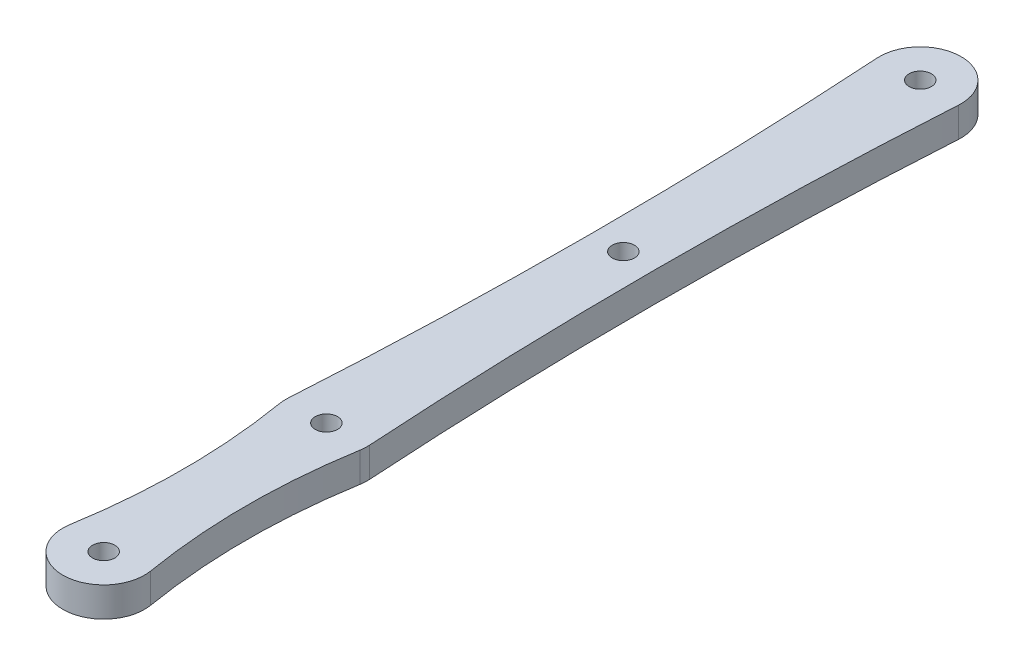
ISO-10303-21;
HEADER;
FILE_DESCRIPTION(('STEP AP214'),'2;1');
FILE_NAME('part.step','',(''),(''),'','','');
FILE_SCHEMA(('AUTOMOTIVE_DESIGN { 1 0 10303 214 1 1 1 1 }'));
ENDSEC;
DATA;
#1=APPLICATION_CONTEXT('core data for automotive mechanical design processes');
#2=APPLICATION_PROTOCOL_DEFINITION('international standard','automotive_design',2000,#1);
#3=PRODUCT_CONTEXT('',#1,'mechanical');
#4=PRODUCT('Part','Part','',(#3));
#5=PRODUCT_RELATED_PRODUCT_CATEGORY('part','',(#4));
#6=PRODUCT_DEFINITION_FORMATION('','',#4);
#7=PRODUCT_DEFINITION_CONTEXT('part definition',#1,'design');
#8=PRODUCT_DEFINITION('design','',#6,#7);
#9=PRODUCT_DEFINITION_SHAPE('','',#8);
#10=(LENGTH_UNIT() NAMED_UNIT(*) SI_UNIT(.MILLI.,.METRE.));
#11=(NAMED_UNIT(*) PLANE_ANGLE_UNIT() SI_UNIT($,.RADIAN.));
#12=(NAMED_UNIT(*) SI_UNIT($,.STERADIAN.) SOLID_ANGLE_UNIT());
#13=UNCERTAINTY_MEASURE_WITH_UNIT(LENGTH_MEASURE(1.E-05),#10,'distance_accuracy_value','');
#14=(GEOMETRIC_REPRESENTATION_CONTEXT(3) GLOBAL_UNCERTAINTY_ASSIGNED_CONTEXT((#13)) GLOBAL_UNIT_ASSIGNED_CONTEXT((#10,
#11,#12)) REPRESENTATION_CONTEXT('',''));
#15=CARTESIAN_POINT('',(0.,0.,0.));
#16=DIRECTION('',(0.,0.,1.));
#17=DIRECTION('',(1.,0.,0.));
#18=AXIS2_PLACEMENT_3D('',#15,#16,#17);
#19=CARTESIAN_POINT('',(-319.687499999935,4.,-89.9999999999999));
#20=DIRECTION('',(0.,1.,0.));
#21=DIRECTION('',(0.,0.,1.));
#22=AXIS2_PLACEMENT_3D('',#19,#20,#21);
#23=PLANE('',#22);
#24=CARTESIAN_POINT('',(0.,4.,-110.));
#25=DIRECTION('',(0.,1.,0.));
#26=DIRECTION('',(0.,0.,1.));
#27=AXIS2_PLACEMENT_3D('',#24,#25,#26);
#28=CIRCLE('',#27,1.5);
#29=CARTESIAN_POINT('',(0.,4.,-108.5));
#30=VERTEX_POINT('',#29);
#31=EDGE_CURVE('E188',#30,#30,#28,.T.);
#32=ORIENTED_EDGE('',*,*,#31,.F.);
#33=EDGE_LOOP('',(#32));
#34=FACE_BOUND('',#33,.T.);
#35=CARTESIAN_POINT('',(0.,4.,-30.));
#36=DIRECTION('',(0.,1.,0.));
#37=DIRECTION('',(0.,0.,1.));
#38=AXIS2_PLACEMENT_3D('',#35,#36,#37);
#39=CIRCLE('',#38,1.5);
#40=CARTESIAN_POINT('',(0.,4.,-28.5));
#41=VERTEX_POINT('',#40);
#42=EDGE_CURVE('E134',#41,#41,#39,.T.);
#43=ORIENTED_EDGE('',*,*,#42,.F.);
#44=EDGE_LOOP('',(#43));
#45=FACE_BOUND('',#44,.T.);
#46=CARTESIAN_POINT('',(-639.37499999987,4.,-69.9999999999999));
#47=DIRECTION('',(0.,-1.,0.));
#48=DIRECTION('',(0.,0.,1.));
#49=AXIS2_PLACEMENT_3D('',#46,#47,#48);
#50=CIRCLE('',#49,635.12499999987);
#51=CARTESIAN_POINT('',(-5.4892682926832,4.,-109.656585365854));
#52=VERTEX_POINT('',#51);
#53=CARTESIAN_POINT('',(-5.48926829268316,4.,-30.3434146341464));
#54=VERTEX_POINT('',#53);
#55=EDGE_CURVE('E145',#52,#54,#50,.T.);
#56=ORIENTED_EDGE('',*,*,#55,.T.);
#57=CARTESIAN_POINT('',(0.,4.,-30.));
#58=DIRECTION('',(0.,1.,0.));
#59=DIRECTION('',(0.,0.,1.));
#60=AXIS2_PLACEMENT_3D('',#57,#58,#59);
#61=CIRCLE('',#60,5.50000000000023);
#62=CARTESIAN_POINT('',(-5.42413793103468,4.,-29.0896551724136));
#63=VERTEX_POINT('',#62);
#64=EDGE_CURVE('E93',#54,#63,#61,.T.);
#65=ORIENTED_EDGE('',*,*,#64,.T.);
#66=CARTESIAN_POINT('',(-89.3749999999824,4.,-15.));
#67=DIRECTION('',(0.,-1.,0.));
#68=DIRECTION('',(0.,0.,1.));
#69=AXIS2_PLACEMENT_3D('',#66,#67,#68);
#70=CIRCLE('',#69,85.1249999999824);
#71=CARTESIAN_POINT('',(-5.42413793103468,4.,-0.91034482758642));
#72=VERTEX_POINT('',#71);
#73=EDGE_CURVE('E160',#63,#72,#70,.T.);
#74=ORIENTED_EDGE('',*,*,#73,.T.);
#75=CARTESIAN_POINT('',(0.,4.,0.));
#76=DIRECTION('',(0.,1.,0.));
#77=DIRECTION('',(0.,0.,1.));
#78=AXIS2_PLACEMENT_3D('',#75,#76,#77);
#79=CIRCLE('',#78,5.50000000000023);
#80=CARTESIAN_POINT('',(5.42413793103468,4.,-0.910344827586403));
#81=VERTEX_POINT('',#80);
#82=EDGE_CURVE('E173',#72,#81,#79,.T.);
#83=ORIENTED_EDGE('',*,*,#82,.T.);
#84=CARTESIAN_POINT('',(89.3749999999824,4.,-15.));
#85=DIRECTION('',(0.,-1.,0.));
#86=DIRECTION('',(0.,0.,-1.));
#87=AXIS2_PLACEMENT_3D('',#84,#85,#86);
#88=CIRCLE('',#87,85.1249999999824);
#89=CARTESIAN_POINT('',(5.42413793103469,4.,-29.0896551724136));
#90=VERTEX_POINT('',#89);
#91=EDGE_CURVE('E112',#81,#90,#88,.T.);
#92=ORIENTED_EDGE('',*,*,#91,.T.);
#93=CARTESIAN_POINT('',(0.,4.,-30.));
#94=DIRECTION('',(0.,1.,0.));
#95=DIRECTION('',(0.,0.,1.));
#96=AXIS2_PLACEMENT_3D('',#93,#94,#95);
#97=CIRCLE('',#96,5.50000000000024);
#98=CARTESIAN_POINT('',(5.48926829268315,4.,-30.3434146341465));
#99=VERTEX_POINT('',#98);
#100=EDGE_CURVE('E106',#90,#99,#97,.T.);
#101=ORIENTED_EDGE('',*,*,#100,.T.);
#102=CARTESIAN_POINT('',(639.37499999987,4.,-69.9999999999999));
#103=DIRECTION('',(0.,-1.,0.));
#104=DIRECTION('',(0.,0.,-1.));
#105=AXIS2_PLACEMENT_3D('',#102,#103,#104);
#106=CIRCLE('',#105,635.12499999987);
#107=CARTESIAN_POINT('',(5.48926829268316,4.,-109.656585365854));
#108=VERTEX_POINT('',#107);
#109=EDGE_CURVE('E110',#99,#108,#106,.T.);
#110=ORIENTED_EDGE('',*,*,#109,.T.);
#111=CARTESIAN_POINT('',(0.,4.,-110.));
#112=DIRECTION('',(0.,1.,0.));
#113=DIRECTION('',(0.,0.,1.));
#114=AXIS2_PLACEMENT_3D('',#111,#112,#113);
#115=CIRCLE('',#114,5.50000000000026);
#116=EDGE_CURVE('E50',#108,#52,#115,.T.);
#117=ORIENTED_EDGE('',*,*,#116,.T.);
#118=EDGE_LOOP('',(#56,#65,#74,#83,#92,#101,#110,#117));
#119=FACE_BOUND('',#118,.T.);
#120=CARTESIAN_POINT('',(0.,4.,0.));
#121=DIRECTION('',(0.,1.,0.));
#122=DIRECTION('',(0.,0.,1.));
#123=AXIS2_PLACEMENT_3D('',#120,#121,#122);
#124=CIRCLE('',#123,1.5);
#125=CARTESIAN_POINT('',(0.,4.,1.5));
#126=VERTEX_POINT('',#125);
#127=EDGE_CURVE('E182',#126,#126,#124,.T.);
#128=ORIENTED_EDGE('',*,*,#127,.F.);
#129=EDGE_LOOP('',(#128));
#130=FACE_BOUND('',#129,.T.);
#131=CARTESIAN_POINT('',(0.,4.,-70.));
#132=DIRECTION('',(0.,1.,0.));
#133=DIRECTION('',(0.,0.,1.));
#134=AXIS2_PLACEMENT_3D('',#131,#132,#133);
#135=CIRCLE('',#134,1.5);
#136=CARTESIAN_POINT('',(0.,4.,-68.5));
#137=VERTEX_POINT('',#136);
#138=EDGE_CURVE('E194',#137,#137,#135,.T.);
#139=ORIENTED_EDGE('',*,*,#138,.F.);
#140=EDGE_LOOP('',(#139));
#141=FACE_BOUND('',#140,.T.);
#142=ADVANCED_FACE('F33',(#34,#45,#119,#130,#141),#23,.T.);
#143=CARTESIAN_POINT('',(-319.687499999935,0.,-89.9999999999999));
#144=DIRECTION('',(0.,1.,0.));
#145=DIRECTION('',(0.,0.,1.));
#146=AXIS2_PLACEMENT_3D('',#143,#144,#145);
#147=PLANE('',#146);
#148=CARTESIAN_POINT('',(-639.37499999987,0.,-69.9999999999999));
#149=DIRECTION('',(0.,-1.,0.));
#150=DIRECTION('',(0.,0.,1.));
#151=AXIS2_PLACEMENT_3D('',#148,#149,#150);
#152=CIRCLE('',#151,635.12499999987);
#153=CARTESIAN_POINT('',(-5.4892682926832,0.,-109.656585365854));
#154=VERTEX_POINT('',#153);
#155=CARTESIAN_POINT('',(-5.48926829268316,0.,-30.3434146341464));
#156=VERTEX_POINT('',#155);
#157=EDGE_CURVE('E130',#154,#156,#152,.T.);
#158=ORIENTED_EDGE('',*,*,#157,.F.);
#159=CARTESIAN_POINT('',(0.,0.,-110.));
#160=DIRECTION('',(0.,1.,0.));
#161=DIRECTION('',(0.,0.,1.));
#162=AXIS2_PLACEMENT_3D('',#159,#160,#161);
#163=CIRCLE('',#162,5.50000000000026);
#164=CARTESIAN_POINT('',(5.48926829268316,0.,-109.656585365854));
#165=VERTEX_POINT('',#164);
#166=EDGE_CURVE('E85',#165,#154,#163,.T.);
#167=ORIENTED_EDGE('',*,*,#166,.F.);
#168=CARTESIAN_POINT('',(639.37499999987,0.,-69.9999999999999));
#169=DIRECTION('',(0.,-1.,0.));
#170=DIRECTION('',(0.,0.,-1.));
#171=AXIS2_PLACEMENT_3D('',#168,#169,#170);
#172=CIRCLE('',#171,635.12499999987);
#173=CARTESIAN_POINT('',(5.48926829268315,0.,-30.3434146341465));
#174=VERTEX_POINT('',#173);
#175=EDGE_CURVE('E79',#174,#165,#172,.T.);
#176=ORIENTED_EDGE('',*,*,#175,.F.);
#177=CARTESIAN_POINT('',(0.,0.,-30.));
#178=DIRECTION('',(0.,1.,0.));
#179=DIRECTION('',(0.,0.,1.));
#180=AXIS2_PLACEMENT_3D('',#177,#178,#179);
#181=CIRCLE('',#180,5.50000000000024);
#182=CARTESIAN_POINT('',(5.42413793103469,0.,-29.0896551724136));
#183=VERTEX_POINT('',#182);
#184=EDGE_CURVE('E120',#183,#174,#181,.T.);
#185=ORIENTED_EDGE('',*,*,#184,.F.);
#186=CARTESIAN_POINT('',(89.3749999999824,0.,-15.));
#187=DIRECTION('',(0.,-1.,0.));
#188=DIRECTION('',(0.,0.,-1.));
#189=AXIS2_PLACEMENT_3D('',#186,#187,#188);
#190=CIRCLE('',#189,85.1249999999824);
#191=CARTESIAN_POINT('',(5.42413793103468,0.,-0.910344827586403));
#192=VERTEX_POINT('',#191);
#193=EDGE_CURVE('E140',#192,#183,#190,.T.);
#194=ORIENTED_EDGE('',*,*,#193,.F.);
#195=CARTESIAN_POINT('',(0.,0.,0.));
#196=DIRECTION('',(0.,1.,0.));
#197=DIRECTION('',(0.,0.,1.));
#198=AXIS2_PLACEMENT_3D('',#195,#196,#197);
#199=CIRCLE('',#198,5.50000000000023);
#200=CARTESIAN_POINT('',(-5.42413793103468,0.,-0.91034482758642));
#201=VERTEX_POINT('',#200);
#202=EDGE_CURVE('E138',#201,#192,#199,.T.);
#203=ORIENTED_EDGE('',*,*,#202,.F.);
#204=CARTESIAN_POINT('',(-89.3749999999824,0.,-15.));
#205=DIRECTION('',(0.,-1.,0.));
#206=DIRECTION('',(0.,0.,1.));
#207=AXIS2_PLACEMENT_3D('',#204,#205,#206);
#208=CIRCLE('',#207,85.1249999999824);
#209=CARTESIAN_POINT('',(-5.42413793103468,0.,-29.0896551724136));
#210=VERTEX_POINT('',#209);
#211=EDGE_CURVE('E136',#210,#201,#208,.T.);
#212=ORIENTED_EDGE('',*,*,#211,.F.);
#213=CARTESIAN_POINT('',(0.,0.,-30.));
#214=DIRECTION('',(0.,1.,0.));
#215=DIRECTION('',(0.,0.,1.));
#216=AXIS2_PLACEMENT_3D('',#213,#214,#215);
#217=CIRCLE('',#216,5.50000000000023);
#218=EDGE_CURVE('E133',#156,#210,#217,.T.);
#219=ORIENTED_EDGE('',*,*,#218,.F.);
#220=EDGE_LOOP('',(#158,#167,#176,#185,#194,#203,#212,#219));
#221=FACE_BOUND('',#220,.T.);
#222=CARTESIAN_POINT('',(0.,0.,-30.));
#223=DIRECTION('',(0.,1.,0.));
#224=DIRECTION('',(0.,0.,1.));
#225=AXIS2_PLACEMENT_3D('',#222,#223,#224);
#226=CIRCLE('',#225,1.5);
#227=CARTESIAN_POINT('',(0.,0.,-28.5));
#228=VERTEX_POINT('',#227);
#229=EDGE_CURVE('E179',#228,#228,#226,.T.);
#230=ORIENTED_EDGE('',*,*,#229,.T.);
#231=EDGE_LOOP('',(#230));
#232=FACE_BOUND('',#231,.T.);
#233=CARTESIAN_POINT('',(0.,0.,0.));
#234=DIRECTION('',(0.,1.,0.));
#235=DIRECTION('',(0.,0.,1.));
#236=AXIS2_PLACEMENT_3D('',#233,#234,#235);
#237=CIRCLE('',#236,1.5);
#238=CARTESIAN_POINT('',(0.,0.,1.5));
#239=VERTEX_POINT('',#238);
#240=EDGE_CURVE('E185',#239,#239,#237,.T.);
#241=ORIENTED_EDGE('',*,*,#240,.T.);
#242=EDGE_LOOP('',(#241));
#243=FACE_BOUND('',#242,.T.);
#244=CARTESIAN_POINT('',(0.,0.,-110.));
#245=DIRECTION('',(0.,1.,0.));
#246=DIRECTION('',(0.,0.,1.));
#247=AXIS2_PLACEMENT_3D('',#244,#245,#246);
#248=CIRCLE('',#247,1.5);
#249=CARTESIAN_POINT('',(0.,0.,-108.5));
#250=VERTEX_POINT('',#249);
#251=EDGE_CURVE('E191',#250,#250,#248,.T.);
#252=ORIENTED_EDGE('',*,*,#251,.T.);
#253=EDGE_LOOP('',(#252));
#254=FACE_BOUND('',#253,.T.);
#255=CARTESIAN_POINT('',(0.,0.,-70.));
#256=DIRECTION('',(0.,1.,0.));
#257=DIRECTION('',(0.,0.,1.));
#258=AXIS2_PLACEMENT_3D('',#255,#256,#257);
#259=CIRCLE('',#258,1.5);
#260=CARTESIAN_POINT('',(0.,0.,-68.5));
#261=VERTEX_POINT('',#260);
#262=EDGE_CURVE('E197',#261,#261,#259,.T.);
#263=ORIENTED_EDGE('',*,*,#262,.T.);
#264=EDGE_LOOP('',(#263));
#265=FACE_BOUND('',#264,.T.);
#266=ADVANCED_FACE('F164',(#221,#232,#243,#254,#265),#147,.F.);
#267=CARTESIAN_POINT('',(-639.37499999987,4.,-69.9999999999999));
#268=DIRECTION('',(0.,-1.,0.));
#269=DIRECTION('',(0.,0.,-1.));
#270=AXIS2_PLACEMENT_3D('',#267,#268,#269);
#271=CYLINDRICAL_SURFACE('',#270,635.12499999987);
#272=ORIENTED_EDGE('',*,*,#157,.T.);
#273=DIRECTION('',(0.,-1.,0.));
#274=VECTOR('',#273,1.);
#275=CARTESIAN_POINT('',(-5.48926829268316,4.,-30.3434146341464));
#276=LINE('',#275,#274);
#277=EDGE_CURVE('E11',#54,#156,#276,.T.);
#278=ORIENTED_EDGE('',*,*,#277,.F.);
#279=ORIENTED_EDGE('',*,*,#55,.F.);
#280=DIRECTION('',(0.,-1.,0.));
#281=VECTOR('',#280,1.);
#282=CARTESIAN_POINT('',(-5.4892682926832,4.,-109.656585365854));
#283=LINE('',#282,#281);
#284=EDGE_CURVE('E126',#52,#154,#283,.T.);
#285=ORIENTED_EDGE('',*,*,#284,.T.);
#286=EDGE_LOOP('',(#272,#278,#279,#285));
#287=FACE_BOUND('',#286,.T.);
#288=ADVANCED_FACE('F35',(#287),#271,.F.);
#289=CARTESIAN_POINT('',(0.,4.,-30.));
#290=DIRECTION('',(0.,-1.,0.));
#291=DIRECTION('',(0.,0.,-1.));
#292=AXIS2_PLACEMENT_3D('',#289,#290,#291);
#293=CYLINDRICAL_SURFACE('',#292,5.50000000000023);
#294=ORIENTED_EDGE('',*,*,#218,.T.);
#295=DIRECTION('',(0.,-1.,0.));
#296=VECTOR('',#295,1.);
#297=CARTESIAN_POINT('',(-5.42413793103468,4.,-29.0896551724136));
#298=LINE('',#297,#296);
#299=EDGE_CURVE('E42',#63,#210,#298,.T.);
#300=ORIENTED_EDGE('',*,*,#299,.F.);
#301=ORIENTED_EDGE('',*,*,#64,.F.);
#302=ORIENTED_EDGE('',*,*,#277,.T.);
#303=EDGE_LOOP('',(#294,#300,#301,#302));
#304=FACE_BOUND('',#303,.T.);
#305=ADVANCED_FACE('F231',(#304),#293,.T.);
#306=CARTESIAN_POINT('',(-89.3749999999824,4.,-15.));
#307=DIRECTION('',(0.,-1.,0.));
#308=DIRECTION('',(0.,0.,-1.));
#309=AXIS2_PLACEMENT_3D('',#306,#307,#308);
#310=CYLINDRICAL_SURFACE('',#309,85.1249999999824);
#311=ORIENTED_EDGE('',*,*,#211,.T.);
#312=DIRECTION('',(0.,-1.,0.));
#313=VECTOR('',#312,1.);
#314=CARTESIAN_POINT('',(-5.42413793103468,4.,-0.91034482758642));
#315=LINE('',#314,#313);
#316=EDGE_CURVE('E152',#72,#201,#315,.T.);
#317=ORIENTED_EDGE('',*,*,#316,.F.);
#318=ORIENTED_EDGE('',*,*,#73,.F.);
#319=ORIENTED_EDGE('',*,*,#299,.T.);
#320=EDGE_LOOP('',(#311,#317,#318,#319));
#321=FACE_BOUND('',#320,.T.);
#322=ADVANCED_FACE('F158',(#321),#310,.F.);
#323=CARTESIAN_POINT('',(0.,4.,0.));
#324=DIRECTION('',(0.,-1.,0.));
#325=DIRECTION('',(0.,0.,-1.));
#326=AXIS2_PLACEMENT_3D('',#323,#324,#325);
#327=CYLINDRICAL_SURFACE('',#326,5.50000000000023);
#328=ORIENTED_EDGE('',*,*,#202,.T.);
#329=DIRECTION('',(0.,-1.,0.));
#330=VECTOR('',#329,1.);
#331=CARTESIAN_POINT('',(5.42413793103468,4.,-0.910344827586403));
#332=LINE('',#331,#330);
#333=EDGE_CURVE('E149',#81,#192,#332,.T.);
#334=ORIENTED_EDGE('',*,*,#333,.F.);
#335=ORIENTED_EDGE('',*,*,#82,.F.);
#336=ORIENTED_EDGE('',*,*,#316,.T.);
#337=EDGE_LOOP('',(#328,#334,#335,#336));
#338=FACE_BOUND('',#337,.T.);
#339=ADVANCED_FACE('F169',(#338),#327,.T.);
#340=CARTESIAN_POINT('',(89.3749999999824,4.,-15.));
#341=DIRECTION('',(0.,-1.,0.));
#342=DIRECTION('',(0.,0.,-1.));
#343=AXIS2_PLACEMENT_3D('',#340,#341,#342);
#344=CYLINDRICAL_SURFACE('',#343,85.1249999999824);
#345=ORIENTED_EDGE('',*,*,#193,.T.);
#346=DIRECTION('',(0.,-1.,0.));
#347=VECTOR('',#346,1.);
#348=CARTESIAN_POINT('',(5.42413793103469,4.,-29.0896551724136));
#349=LINE('',#348,#347);
#350=EDGE_CURVE('E121',#90,#183,#349,.T.);
#351=ORIENTED_EDGE('',*,*,#350,.F.);
#352=ORIENTED_EDGE('',*,*,#91,.F.);
#353=ORIENTED_EDGE('',*,*,#333,.T.);
#354=EDGE_LOOP('',(#345,#351,#352,#353));
#355=FACE_BOUND('',#354,.T.);
#356=ADVANCED_FACE('F172',(#355),#344,.F.);
#357=CARTESIAN_POINT('',(0.,4.,-30.));
#358=DIRECTION('',(0.,-1.,0.));
#359=DIRECTION('',(0.,0.,-1.));
#360=AXIS2_PLACEMENT_3D('',#357,#358,#359);
#361=CYLINDRICAL_SURFACE('',#360,5.50000000000024);
#362=ORIENTED_EDGE('',*,*,#184,.T.);
#363=DIRECTION('',(0.,-1.,0.));
#364=VECTOR('',#363,1.);
#365=CARTESIAN_POINT('',(5.48926829268315,4.,-30.3434146341465));
#366=LINE('',#365,#364);
#367=EDGE_CURVE('E117',#99,#174,#366,.T.);
#368=ORIENTED_EDGE('',*,*,#367,.F.);
#369=ORIENTED_EDGE('',*,*,#100,.F.);
#370=ORIENTED_EDGE('',*,*,#350,.T.);
#371=EDGE_LOOP('',(#362,#368,#369,#370));
#372=FACE_BOUND('',#371,.T.);
#373=ADVANCED_FACE('F118',(#372),#361,.T.);
#374=CARTESIAN_POINT('',(639.37499999987,4.,-69.9999999999999));
#375=DIRECTION('',(0.,-1.,0.));
#376=DIRECTION('',(0.,0.,-1.));
#377=AXIS2_PLACEMENT_3D('',#374,#375,#376);
#378=CYLINDRICAL_SURFACE('',#377,635.12499999987);
#379=ORIENTED_EDGE('',*,*,#175,.T.);
#380=DIRECTION('',(0.,-1.,0.));
#381=VECTOR('',#380,1.);
#382=CARTESIAN_POINT('',(5.48926829268316,4.,-109.656585365854));
#383=LINE('',#382,#381);
#384=EDGE_CURVE('E122',#108,#165,#383,.T.);
#385=ORIENTED_EDGE('',*,*,#384,.F.);
#386=ORIENTED_EDGE('',*,*,#109,.F.);
#387=ORIENTED_EDGE('',*,*,#367,.T.);
#388=EDGE_LOOP('',(#379,#385,#386,#387));
#389=FACE_BOUND('',#388,.T.);
#390=ADVANCED_FACE('F124',(#389),#378,.F.);
#391=CARTESIAN_POINT('',(0.,4.,-110.));
#392=DIRECTION('',(0.,-1.,0.));
#393=DIRECTION('',(0.,0.,-1.));
#394=AXIS2_PLACEMENT_3D('',#391,#392,#393);
#395=CYLINDRICAL_SURFACE('',#394,5.50000000000026);
#396=ORIENTED_EDGE('',*,*,#166,.T.);
#397=ORIENTED_EDGE('',*,*,#284,.F.);
#398=ORIENTED_EDGE('',*,*,#116,.F.);
#399=ORIENTED_EDGE('',*,*,#384,.T.);
#400=EDGE_LOOP('',(#396,#397,#398,#399));
#401=FACE_BOUND('',#400,.T.);
#402=ADVANCED_FACE('F219',(#401),#395,.T.);
#403=CARTESIAN_POINT('',(0.,4.,-30.));
#404=DIRECTION('',(0.,-1.,0.));
#405=DIRECTION('',(0.,0.,-1.));
#406=AXIS2_PLACEMENT_3D('',#403,#404,#405);
#407=CYLINDRICAL_SURFACE('',#406,1.5);
#408=ORIENTED_EDGE('',*,*,#42,.T.);
#409=EDGE_LOOP('',(#408));
#410=FACE_BOUND('',#409,.T.);
#411=ORIENTED_EDGE('',*,*,#229,.F.);
#412=EDGE_LOOP('',(#411));
#413=FACE_BOUND('',#412,.T.);
#414=ADVANCED_FACE('F216',(#410,#413),#407,.F.);
#415=CARTESIAN_POINT('',(0.,4.,0.));
#416=DIRECTION('',(0.,-1.,0.));
#417=DIRECTION('',(0.,0.,-1.));
#418=AXIS2_PLACEMENT_3D('',#415,#416,#417);
#419=CYLINDRICAL_SURFACE('',#418,1.5);
#420=ORIENTED_EDGE('',*,*,#127,.T.);
#421=EDGE_LOOP('',(#420));
#422=FACE_BOUND('',#421,.T.);
#423=ORIENTED_EDGE('',*,*,#240,.F.);
#424=EDGE_LOOP('',(#423));
#425=FACE_BOUND('',#424,.T.);
#426=ADVANCED_FACE('F295',(#422,#425),#419,.F.);
#427=CARTESIAN_POINT('',(0.,4.,-110.));
#428=DIRECTION('',(0.,-1.,0.));
#429=DIRECTION('',(0.,0.,-1.));
#430=AXIS2_PLACEMENT_3D('',#427,#428,#429);
#431=CYLINDRICAL_SURFACE('',#430,1.5);
#432=ORIENTED_EDGE('',*,*,#31,.T.);
#433=EDGE_LOOP('',(#432));
#434=FACE_BOUND('',#433,.T.);
#435=ORIENTED_EDGE('',*,*,#251,.F.);
#436=EDGE_LOOP('',(#435));
#437=FACE_BOUND('',#436,.T.);
#438=ADVANCED_FACE('F303',(#434,#437),#431,.F.);
#439=CARTESIAN_POINT('',(0.,4.,-70.));
#440=DIRECTION('',(0.,-1.,0.));
#441=DIRECTION('',(0.,0.,-1.));
#442=AXIS2_PLACEMENT_3D('',#439,#440,#441);
#443=CYLINDRICAL_SURFACE('',#442,1.5);
#444=ORIENTED_EDGE('',*,*,#138,.T.);
#445=EDGE_LOOP('',(#444));
#446=FACE_BOUND('',#445,.T.);
#447=ORIENTED_EDGE('',*,*,#262,.F.);
#448=EDGE_LOOP('',(#447));
#449=FACE_BOUND('',#448,.T.);
#450=ADVANCED_FACE('F203',(#446,#449),#443,.F.);
#451=CLOSED_SHELL('',(#142,#266,#288,#305,#322,#339,#356,#373,#390,#402,#414,#426,#438,#450));
#452=MANIFOLD_SOLID_BREP('B2',#451);
#453=ADVANCED_BREP_SHAPE_REPRESENTATION('',(#18,#452),#14);
#454=SHAPE_DEFINITION_REPRESENTATION(#9,#453);
ENDSEC;
END-ISO-10303-21;
